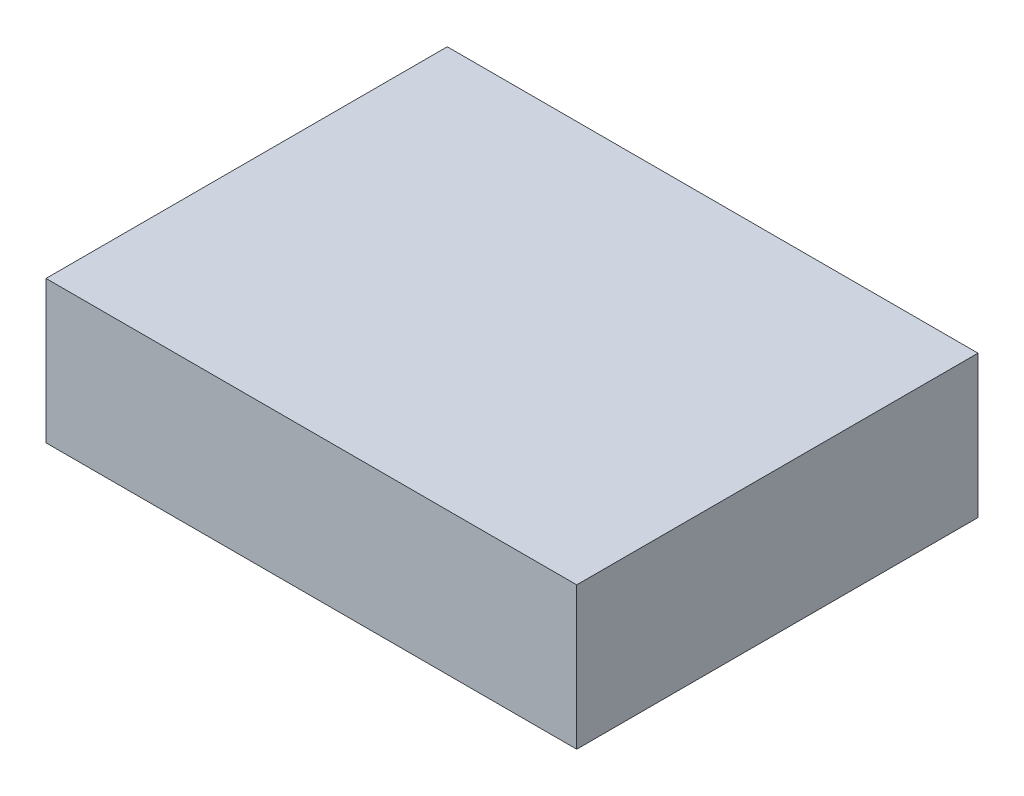
ISO-10303-21;
HEADER;
FILE_DESCRIPTION(('STEP AP214'),'2;1');
FILE_NAME('part.step','',(''),(''),'','','');
FILE_SCHEMA(('AUTOMOTIVE_DESIGN { 1 0 10303 214 1 1 1 1 }'));
ENDSEC;
DATA;
#1=APPLICATION_CONTEXT('core data for automotive mechanical design processes');
#2=APPLICATION_PROTOCOL_DEFINITION('international standard','automotive_design',2000,#1);
#3=PRODUCT_CONTEXT('',#1,'mechanical');
#4=PRODUCT('Part','Part','',(#3));
#5=PRODUCT_RELATED_PRODUCT_CATEGORY('part','',(#4));
#6=PRODUCT_DEFINITION_FORMATION('','',#4);
#7=PRODUCT_DEFINITION_CONTEXT('part definition',#1,'design');
#8=PRODUCT_DEFINITION('design','',#6,#7);
#9=PRODUCT_DEFINITION_SHAPE('','',#8);
#10=(LENGTH_UNIT() NAMED_UNIT(*) SI_UNIT(.MILLI.,.METRE.));
#11=(NAMED_UNIT(*) PLANE_ANGLE_UNIT() SI_UNIT($,.RADIAN.));
#12=(NAMED_UNIT(*) SI_UNIT($,.STERADIAN.) SOLID_ANGLE_UNIT());
#13=UNCERTAINTY_MEASURE_WITH_UNIT(LENGTH_MEASURE(1.E-05),#10,'distance_accuracy_value','');
#14=(GEOMETRIC_REPRESENTATION_CONTEXT(3) GLOBAL_UNCERTAINTY_ASSIGNED_CONTEXT((#13)) GLOBAL_UNIT_ASSIGNED_CONTEXT((#10,
#11,#12)) REPRESENTATION_CONTEXT('',''));
#15=CARTESIAN_POINT('',(0.,0.,0.));
#16=DIRECTION('',(0.,0.,1.));
#17=DIRECTION('',(1.,0.,0.));
#18=AXIS2_PLACEMENT_3D('',#15,#16,#17);
#19=CARTESIAN_POINT('',(-41.,50.9291308994878,31.));
#20=DIRECTION('',(-1.,0.,0.));
#21=DIRECTION('',(0.,0.,1.));
#22=AXIS2_PLACEMENT_3D('',#19,#20,#21);
#23=PLANE('',#22);
#24=DIRECTION('',(0.,0.,-1.));
#25=VECTOR('',#24,1.);
#26=CARTESIAN_POINT('',(-41.,28.9291308994879,31.));
#27=LINE('',#26,#25);
#28=CARTESIAN_POINT('',(-41.,28.9291308994879,31.));
#29=VERTEX_POINT('',#28);
#30=CARTESIAN_POINT('',(-41.,28.9291308994879,-31.));
#31=VERTEX_POINT('',#30);
#32=EDGE_CURVE('E97',#29,#31,#27,.T.);
#33=ORIENTED_EDGE('',*,*,#32,.F.);
#34=DIRECTION('',(0.,-1.,0.));
#35=VECTOR('',#34,1.);
#36=CARTESIAN_POINT('',(-41.,50.9291308994878,31.));
#37=LINE('',#36,#35);
#38=CARTESIAN_POINT('',(-41.,50.9291308994878,31.));
#39=VERTEX_POINT('',#38);
#40=EDGE_CURVE('E11',#39,#29,#37,.T.);
#41=ORIENTED_EDGE('',*,*,#40,.F.);
#42=DIRECTION('',(0.,0.,-1.));
#43=VECTOR('',#42,1.);
#44=CARTESIAN_POINT('',(-41.,50.9291308994878,31.));
#45=LINE('',#44,#43);
#46=CARTESIAN_POINT('',(-41.,50.9291308994878,-31.));
#47=VERTEX_POINT('',#46);
#48=EDGE_CURVE('E91',#39,#47,#45,.T.);
#49=ORIENTED_EDGE('',*,*,#48,.T.);
#50=DIRECTION('',(0.,-1.,0.));
#51=VECTOR('',#50,1.);
#52=CARTESIAN_POINT('',(-41.,50.9291308994878,-31.));
#53=LINE('',#52,#51);
#54=EDGE_CURVE('E36',#47,#31,#53,.T.);
#55=ORIENTED_EDGE('',*,*,#54,.T.);
#56=EDGE_LOOP('',(#33,#41,#49,#55));
#57=FACE_BOUND('',#56,.T.);
#58=ADVANCED_FACE('F33',(#57),#23,.T.);
#59=CARTESIAN_POINT('',(-41.,50.9291308994878,31.));
#60=DIRECTION('',(0.,0.,1.));
#61=DIRECTION('',(1.,0.,0.));
#62=AXIS2_PLACEMENT_3D('',#59,#60,#61);
#63=PLANE('',#62);
#64=DIRECTION('',(-1.,0.,0.));
#65=VECTOR('',#64,1.);
#66=CARTESIAN_POINT('',(-41.,28.9291308994879,31.));
#67=LINE('',#66,#65);
#68=CARTESIAN_POINT('',(41.,28.9291308994879,31.));
#69=VERTEX_POINT('',#68);
#70=EDGE_CURVE('E93',#69,#29,#67,.T.);
#71=ORIENTED_EDGE('',*,*,#70,.F.);
#72=DIRECTION('',(0.,-1.,0.));
#73=VECTOR('',#72,1.);
#74=CARTESIAN_POINT('',(41.,50.9291308994878,31.));
#75=LINE('',#74,#73);
#76=CARTESIAN_POINT('',(41.,50.9291308994878,31.));
#77=VERTEX_POINT('',#76);
#78=EDGE_CURVE('E42',#77,#69,#75,.T.);
#79=ORIENTED_EDGE('',*,*,#78,.F.);
#80=DIRECTION('',(-1.,0.,0.));
#81=VECTOR('',#80,1.);
#82=CARTESIAN_POINT('',(-41.,50.9291308994878,31.));
#83=LINE('',#82,#81);
#84=EDGE_CURVE('E88',#77,#39,#83,.T.);
#85=ORIENTED_EDGE('',*,*,#84,.T.);
#86=ORIENTED_EDGE('',*,*,#40,.T.);
#87=EDGE_LOOP('',(#71,#79,#85,#86));
#88=FACE_BOUND('',#87,.T.);
#89=ADVANCED_FACE('F107',(#88),#63,.T.);
#90=CARTESIAN_POINT('',(41.,50.9291308994878,31.));
#91=DIRECTION('',(1.,0.,0.));
#92=DIRECTION('',(0.,0.,-1.));
#93=AXIS2_PLACEMENT_3D('',#90,#91,#92);
#94=PLANE('',#93);
#95=DIRECTION('',(0.,0.,1.));
#96=VECTOR('',#95,1.);
#97=CARTESIAN_POINT('',(41.,28.9291308994879,31.));
#98=LINE('',#97,#96);
#99=CARTESIAN_POINT('',(41.,28.9291308994879,-31.));
#100=VERTEX_POINT('',#99);
#101=EDGE_CURVE('E83',#100,#69,#98,.T.);
#102=ORIENTED_EDGE('',*,*,#101,.F.);
#103=DIRECTION('',(0.,-1.,0.));
#104=VECTOR('',#103,1.);
#105=CARTESIAN_POINT('',(41.,50.9291308994878,-31.));
#106=LINE('',#105,#104);
#107=CARTESIAN_POINT('',(41.,50.9291308994878,-31.));
#108=VERTEX_POINT('',#107);
#109=EDGE_CURVE('E78',#108,#100,#106,.T.);
#110=ORIENTED_EDGE('',*,*,#109,.F.);
#111=DIRECTION('',(0.,0.,1.));
#112=VECTOR('',#111,1.);
#113=CARTESIAN_POINT('',(41.,50.9291308994878,31.));
#114=LINE('',#113,#112);
#115=EDGE_CURVE('E81',#108,#77,#114,.T.);
#116=ORIENTED_EDGE('',*,*,#115,.T.);
#117=ORIENTED_EDGE('',*,*,#78,.T.);
#118=EDGE_LOOP('',(#102,#110,#116,#117));
#119=FACE_BOUND('',#118,.T.);
#120=ADVANCED_FACE('F80',(#119),#94,.T.);
#121=CARTESIAN_POINT('',(-41.,50.9291308994878,-31.));
#122=DIRECTION('',(0.,0.,-1.));
#123=DIRECTION('',(-1.,0.,0.));
#124=AXIS2_PLACEMENT_3D('',#121,#122,#123);
#125=PLANE('',#124);
#126=DIRECTION('',(1.,0.,0.));
#127=VECTOR('',#126,1.);
#128=CARTESIAN_POINT('',(-41.,28.9291308994879,-31.));
#129=LINE('',#128,#127);
#130=EDGE_CURVE('E100',#31,#100,#129,.T.);
#131=ORIENTED_EDGE('',*,*,#130,.F.);
#132=ORIENTED_EDGE('',*,*,#54,.F.);
#133=DIRECTION('',(1.,0.,0.));
#134=VECTOR('',#133,1.);
#135=CARTESIAN_POINT('',(-41.,50.9291308994878,-31.));
#136=LINE('',#135,#134);
#137=EDGE_CURVE('E87',#47,#108,#136,.T.);
#138=ORIENTED_EDGE('',*,*,#137,.T.);
#139=ORIENTED_EDGE('',*,*,#109,.T.);
#140=EDGE_LOOP('',(#131,#132,#138,#139));
#141=FACE_BOUND('',#140,.T.);
#142=ADVANCED_FACE('F90',(#141),#125,.T.);
#143=CARTESIAN_POINT('',(0.,50.9291308994878,0.));
#144=DIRECTION('',(0.,-1.,0.));
#145=DIRECTION('',(0.,0.,-1.));
#146=AXIS2_PLACEMENT_3D('',#143,#144,#145);
#147=PLANE('',#146);
#148=ORIENTED_EDGE('',*,*,#48,.F.);
#149=ORIENTED_EDGE('',*,*,#84,.F.);
#150=ORIENTED_EDGE('',*,*,#115,.F.);
#151=ORIENTED_EDGE('',*,*,#137,.F.);
#152=EDGE_LOOP('',(#148,#149,#150,#151));
#153=FACE_BOUND('',#152,.T.);
#154=ADVANCED_FACE('F86',(#153),#147,.F.);
#155=CARTESIAN_POINT('',(0.,28.9291308994879,0.));
#156=DIRECTION('',(0.,-1.,0.));
#157=DIRECTION('',(0.,0.,-1.));
#158=AXIS2_PLACEMENT_3D('',#155,#156,#157);
#159=PLANE('',#158);
#160=ORIENTED_EDGE('',*,*,#32,.T.);
#161=ORIENTED_EDGE('',*,*,#130,.T.);
#162=ORIENTED_EDGE('',*,*,#101,.T.);
#163=ORIENTED_EDGE('',*,*,#70,.T.);
#164=EDGE_LOOP('',(#160,#161,#162,#163));
#165=FACE_BOUND('',#164,.T.);
#166=ADVANCED_FACE('F106',(#165),#159,.T.);
#167=CLOSED_SHELL('',(#58,#89,#120,#142,#154,#166));
#168=MANIFOLD_SOLID_BREP('B2',#167);
#169=ADVANCED_BREP_SHAPE_REPRESENTATION('',(#18,#168),#14);
#170=SHAPE_DEFINITION_REPRESENTATION(#9,#169);
ENDSEC;
END-ISO-10303-21;
